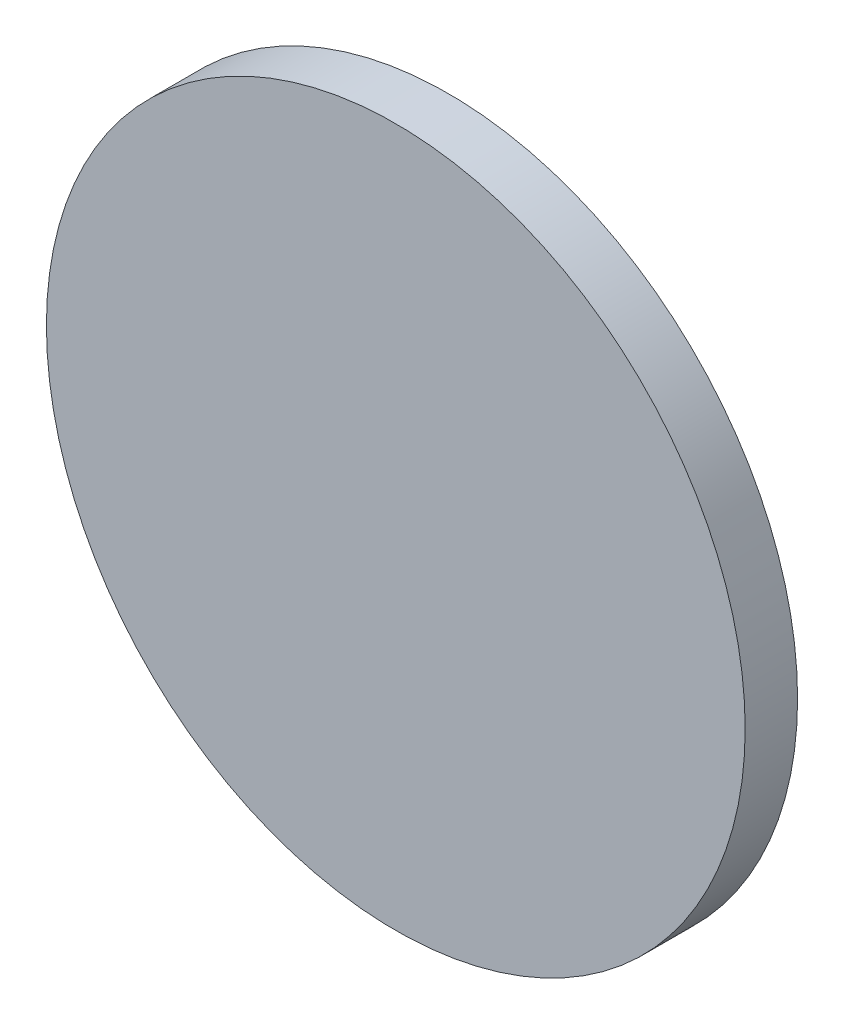
ISO-10303-21;
HEADER;
FILE_DESCRIPTION(('STEP AP214'),'2;1');
FILE_NAME('part.step','',(''),(''),'','','');
FILE_SCHEMA(('AUTOMOTIVE_DESIGN { 1 0 10303 214 1 1 1 1 }'));
ENDSEC;
DATA;
#1=APPLICATION_CONTEXT('core data for automotive mechanical design processes');
#2=APPLICATION_PROTOCOL_DEFINITION('international standard','automotive_design',2000,#1);
#3=PRODUCT_CONTEXT('',#1,'mechanical');
#4=PRODUCT('Part','Part','',(#3));
#5=PRODUCT_RELATED_PRODUCT_CATEGORY('part','',(#4));
#6=PRODUCT_DEFINITION_FORMATION('','',#4);
#7=PRODUCT_DEFINITION_CONTEXT('part definition',#1,'design');
#8=PRODUCT_DEFINITION('design','',#6,#7);
#9=PRODUCT_DEFINITION_SHAPE('','',#8);
#10=(LENGTH_UNIT() NAMED_UNIT(*) SI_UNIT(.MILLI.,.METRE.));
#11=(NAMED_UNIT(*) PLANE_ANGLE_UNIT() SI_UNIT($,.RADIAN.));
#12=(NAMED_UNIT(*) SI_UNIT($,.STERADIAN.) SOLID_ANGLE_UNIT());
#13=UNCERTAINTY_MEASURE_WITH_UNIT(LENGTH_MEASURE(1.E-05),#10,'distance_accuracy_value','');
#14=(GEOMETRIC_REPRESENTATION_CONTEXT(3) GLOBAL_UNCERTAINTY_ASSIGNED_CONTEXT((#13)) GLOBAL_UNIT_ASSIGNED_CONTEXT((#10,
#11,#12)) REPRESENTATION_CONTEXT('',''));
#15=CARTESIAN_POINT('',(0.,0.,0.));
#16=DIRECTION('',(0.,0.,1.));
#17=DIRECTION('',(1.,0.,0.));
#18=AXIS2_PLACEMENT_3D('',#15,#16,#17);
#19=CARTESIAN_POINT('',(4.15748,13.13473,0.03429));
#20=DIRECTION('',(0.,0.,1.));
#21=DIRECTION('',(1.,0.,0.));
#22=AXIS2_PLACEMENT_3D('',#19,#20,#21);
#23=PLANE('',#22);
#24=CARTESIAN_POINT('',(4.15748,13.13473,0.03429));
#25=DIRECTION('',(0.,0.,1.));
#26=DIRECTION('',(1.,0.,0.));
#27=AXIS2_PLACEMENT_3D('',#24,#25,#26);
#28=CIRCLE('',#27,0.2286);
#29=CARTESIAN_POINT('',(4.38608,13.13473,0.03429));
#30=VERTEX_POINT('',#29);
#31=EDGE_CURVE('E18',#30,#30,#28,.F.);
#32=ORIENTED_EDGE('',*,*,#31,.F.);
#33=EDGE_LOOP('',(#32));
#34=FACE_BOUND('',#33,.T.);
#35=ADVANCED_FACE('F15',(#34),#23,.T.);
#36=CARTESIAN_POINT('',(4.15748,13.13473,0.));
#37=DIRECTION('',(0.,0.,1.));
#38=DIRECTION('',(1.,0.,0.));
#39=AXIS2_PLACEMENT_3D('',#36,#37,#38);
#40=CYLINDRICAL_SURFACE('',#39,0.2286);
#41=ORIENTED_EDGE('',*,*,#31,.T.);
#42=EDGE_LOOP('',(#41));
#43=FACE_BOUND('',#42,.T.);
#44=CARTESIAN_POINT('',(4.15748,13.13473,0.));
#45=DIRECTION('',(0.,0.,1.));
#46=DIRECTION('',(1.,0.,0.));
#47=AXIS2_PLACEMENT_3D('',#44,#45,#46);
#48=CIRCLE('',#47,0.2286);
#49=CARTESIAN_POINT('',(4.38608,13.13473,0.));
#50=VERTEX_POINT('',#49);
#51=EDGE_CURVE('E10',#50,#50,#48,.F.);
#52=ORIENTED_EDGE('',*,*,#51,.F.);
#53=EDGE_LOOP('',(#52));
#54=FACE_BOUND('',#53,.T.);
#55=ADVANCED_FACE('F27',(#43,#54),#40,.T.);
#56=CARTESIAN_POINT('',(4.15748,13.13473,0.));
#57=DIRECTION('',(0.,0.,-1.));
#58=DIRECTION('',(-1.,0.,0.));
#59=AXIS2_PLACEMENT_3D('',#56,#57,#58);
#60=PLANE('',#59);
#61=ORIENTED_EDGE('',*,*,#51,.T.);
#62=EDGE_LOOP('',(#61));
#63=FACE_BOUND('',#62,.T.);
#64=ADVANCED_FACE('F35',(#63),#60,.T.);
#65=CLOSED_SHELL('',(#35,#55,#64));
#66=MANIFOLD_SOLID_BREP('B1',#65);
#67=ADVANCED_BREP_SHAPE_REPRESENTATION('',(#18,#66),#14);
#68=SHAPE_DEFINITION_REPRESENTATION(#9,#67);
ENDSEC;
END-ISO-10303-21;
